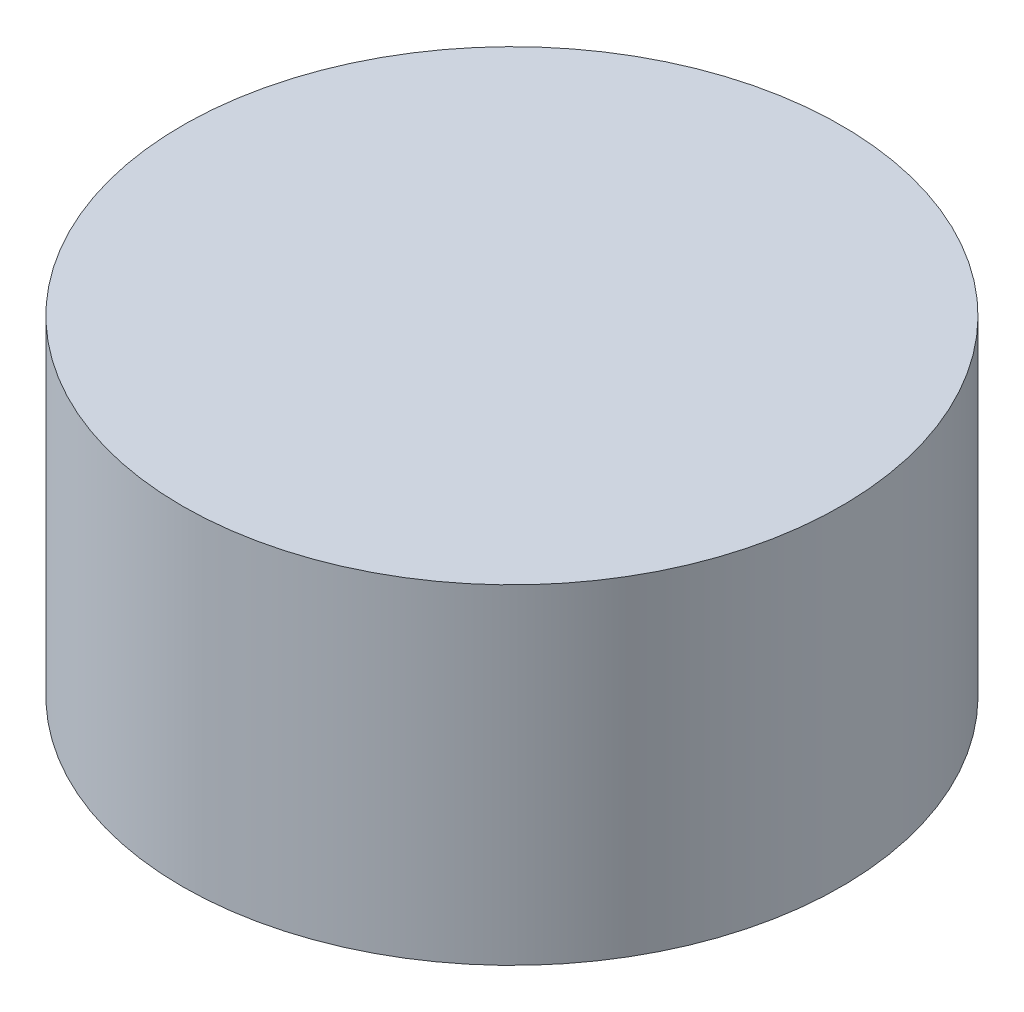
ISO-10303-21;
HEADER;
FILE_DESCRIPTION(('STEP AP214'),'2;1');
FILE_NAME('part.step','',(''),(''),'','','');
FILE_SCHEMA(('AUTOMOTIVE_DESIGN { 1 0 10303 214 1 1 1 1 }'));
ENDSEC;
DATA;
#1=APPLICATION_CONTEXT('core data for automotive mechanical design processes');
#2=APPLICATION_PROTOCOL_DEFINITION('international standard','automotive_design',2000,#1);
#3=PRODUCT_CONTEXT('',#1,'mechanical');
#4=PRODUCT('Part','Part','',(#3));
#5=PRODUCT_RELATED_PRODUCT_CATEGORY('part','',(#4));
#6=PRODUCT_DEFINITION_FORMATION('','',#4);
#7=PRODUCT_DEFINITION_CONTEXT('part definition',#1,'design');
#8=PRODUCT_DEFINITION('design','',#6,#7);
#9=PRODUCT_DEFINITION_SHAPE('','',#8);
#10=(LENGTH_UNIT() NAMED_UNIT(*) SI_UNIT(.MILLI.,.METRE.));
#11=(NAMED_UNIT(*) PLANE_ANGLE_UNIT() SI_UNIT($,.RADIAN.));
#12=(NAMED_UNIT(*) SI_UNIT($,.STERADIAN.) SOLID_ANGLE_UNIT());
#13=UNCERTAINTY_MEASURE_WITH_UNIT(LENGTH_MEASURE(1.E-05),#10,'distance_accuracy_value','');
#14=(GEOMETRIC_REPRESENTATION_CONTEXT(3) GLOBAL_UNCERTAINTY_ASSIGNED_CONTEXT((#13)) GLOBAL_UNIT_ASSIGNED_CONTEXT((#10,
#11,#12)) REPRESENTATION_CONTEXT('',''));
#15=CARTESIAN_POINT('',(0.,0.,0.));
#16=DIRECTION('',(0.,0.,1.));
#17=DIRECTION('',(1.,0.,0.));
#18=AXIS2_PLACEMENT_3D('',#15,#16,#17);
#19=CARTESIAN_POINT('',(0.,5.,0.));
#20=DIRECTION('',(0.,-1.,0.));
#21=DIRECTION('',(0.,0.,-1.));
#22=AXIS2_PLACEMENT_3D('',#19,#20,#21);
#23=CYLINDRICAL_SURFACE('',#22,5.);
#24=CARTESIAN_POINT('',(0.,5.,0.));
#25=DIRECTION('',(0.,1.,0.));
#26=DIRECTION('',(0.,0.,1.));
#27=AXIS2_PLACEMENT_3D('',#24,#25,#26);
#28=CIRCLE('',#27,5.);
#29=CARTESIAN_POINT('',(0.,5.,5.));
#30=VERTEX_POINT('',#29);
#31=EDGE_CURVE('E10',#30,#30,#28,.T.);
#32=ORIENTED_EDGE('',*,*,#31,.F.);
#33=EDGE_LOOP('',(#32));
#34=FACE_BOUND('',#33,.T.);
#35=CARTESIAN_POINT('',(0.,0.,0.));
#36=DIRECTION('',(0.,1.,0.));
#37=DIRECTION('',(0.,0.,1.));
#38=AXIS2_PLACEMENT_3D('',#35,#36,#37);
#39=CIRCLE('',#38,5.);
#40=CARTESIAN_POINT('',(0.,0.,5.));
#41=VERTEX_POINT('',#40);
#42=EDGE_CURVE('E34',#41,#41,#39,.T.);
#43=ORIENTED_EDGE('',*,*,#42,.T.);
#44=EDGE_LOOP('',(#43));
#45=FACE_BOUND('',#44,.T.);
#46=ADVANCED_FACE('F31',(#34,#45),#23,.T.);
#47=CARTESIAN_POINT('',(0.,5.,0.));
#48=DIRECTION('',(0.,1.,0.));
#49=DIRECTION('',(0.,0.,1.));
#50=AXIS2_PLACEMENT_3D('',#47,#48,#49);
#51=PLANE('',#50);
#52=ORIENTED_EDGE('',*,*,#31,.T.);
#53=EDGE_LOOP('',(#52));
#54=FACE_BOUND('',#53,.T.);
#55=ADVANCED_FACE('F46',(#54),#51,.T.);
#56=CARTESIAN_POINT('',(0.,0.,0.));
#57=DIRECTION('',(0.,1.,0.));
#58=DIRECTION('',(0.,0.,1.));
#59=AXIS2_PLACEMENT_3D('',#56,#57,#58);
#60=PLANE('',#59);
#61=ORIENTED_EDGE('',*,*,#42,.F.);
#62=EDGE_LOOP('',(#61));
#63=FACE_BOUND('',#62,.T.);
#64=ADVANCED_FACE('F44',(#63),#60,.F.);
#65=CLOSED_SHELL('',(#46,#55,#64));
#66=MANIFOLD_SOLID_BREP('B2',#65);
#67=ADVANCED_BREP_SHAPE_REPRESENTATION('',(#18,#66),#14);
#68=SHAPE_DEFINITION_REPRESENTATION(#9,#67);
ENDSEC;
END-ISO-10303-21;
